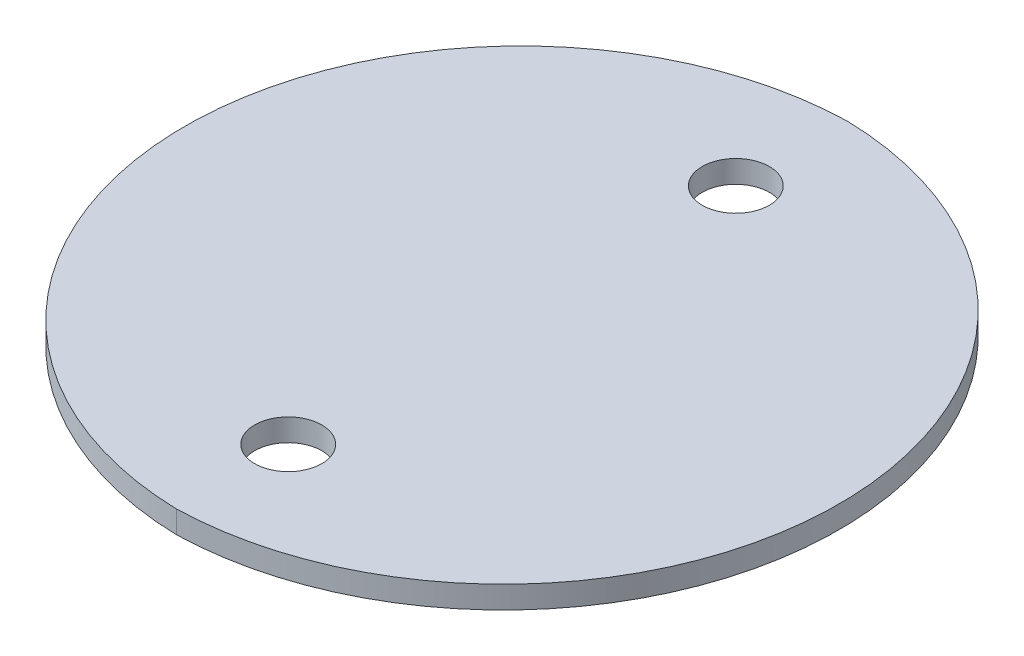
ISO-10303-21;
HEADER;
FILE_DESCRIPTION(('STEP AP214'),'2;1');
FILE_NAME('part.step','',(''),(''),'','','');
FILE_SCHEMA(('AUTOMOTIVE_DESIGN { 1 0 10303 214 1 1 1 1 }'));
ENDSEC;
DATA;
#1=APPLICATION_CONTEXT('core data for automotive mechanical design processes');
#2=APPLICATION_PROTOCOL_DEFINITION('international standard','automotive_design',2000,#1);
#3=PRODUCT_CONTEXT('',#1,'mechanical');
#4=PRODUCT('Part','Part','',(#3));
#5=PRODUCT_RELATED_PRODUCT_CATEGORY('part','',(#4));
#6=PRODUCT_DEFINITION_FORMATION('','',#4);
#7=PRODUCT_DEFINITION_CONTEXT('part definition',#1,'design');
#8=PRODUCT_DEFINITION('design','',#6,#7);
#9=PRODUCT_DEFINITION_SHAPE('','',#8);
#10=(LENGTH_UNIT() NAMED_UNIT(*) SI_UNIT(.MILLI.,.METRE.));
#11=(NAMED_UNIT(*) PLANE_ANGLE_UNIT() SI_UNIT($,.RADIAN.));
#12=(NAMED_UNIT(*) SI_UNIT($,.STERADIAN.) SOLID_ANGLE_UNIT());
#13=UNCERTAINTY_MEASURE_WITH_UNIT(LENGTH_MEASURE(1.E-05),#10,'distance_accuracy_value','');
#14=(GEOMETRIC_REPRESENTATION_CONTEXT(3) GLOBAL_UNCERTAINTY_ASSIGNED_CONTEXT((#13)) GLOBAL_UNIT_ASSIGNED_CONTEXT((#10,
#11,#12)) REPRESENTATION_CONTEXT('',''));
#15=CARTESIAN_POINT('',(0.,0.,0.));
#16=DIRECTION('',(0.,0.,1.));
#17=DIRECTION('',(1.,0.,0.));
#18=AXIS2_PLACEMENT_3D('',#15,#16,#17);
#19=CARTESIAN_POINT('',(0.,1.,0.));
#20=DIRECTION('',(0.,-1.,0.));
#21=DIRECTION('',(0.,0.,-1.));
#22=AXIS2_PLACEMENT_3D('',#19,#20,#21);
#23=PLANE('',#22);
#24=CARTESIAN_POINT('',(-0.387330608137351,1.,0.));
#25=DIRECTION('',(0.,1.,0.));
#26=DIRECTION('',(0.,0.,-1.));
#27=AXIS2_PLACEMENT_3D('',#24,#25,#26);
#28=CIRCLE('',#27,15.005);
#29=CARTESIAN_POINT('',(0.,1.,15.));
#30=VERTEX_POINT('',#29);
#31=CARTESIAN_POINT('',(0.,1.,-15.));
#32=VERTEX_POINT('',#31);
#33=EDGE_CURVE('E63',#30,#32,#28,.T.);
#34=ORIENTED_EDGE('',*,*,#33,.T.);
#35=CARTESIAN_POINT('',(0.387330608137346,1.,0.));
#36=DIRECTION('',(0.,1.,0.));
#37=DIRECTION('',(0.,0.,1.));
#38=AXIS2_PLACEMENT_3D('',#35,#36,#37);
#39=CIRCLE('',#38,15.005);
#40=EDGE_CURVE('E48',#32,#30,#39,.T.);
#41=ORIENTED_EDGE('',*,*,#40,.T.);
#42=EDGE_LOOP('',(#34,#41));
#43=FACE_BOUND('',#42,.T.);
#44=CARTESIAN_POINT('',(0.,1.,-10.));
#45=DIRECTION('',(0.,1.,0.));
#46=DIRECTION('',(0.,0.,1.));
#47=AXIS2_PLACEMENT_3D('',#44,#45,#46);
#48=CIRCLE('',#47,1.5);
#49=CARTESIAN_POINT('',(0.,1.,-8.5));
#50=VERTEX_POINT('',#49);
#51=EDGE_CURVE('E69',#50,#50,#48,.T.);
#52=ORIENTED_EDGE('',*,*,#51,.F.);
#53=EDGE_LOOP('',(#52));
#54=FACE_BOUND('',#53,.T.);
#55=CARTESIAN_POINT('',(0.,1.,10.));
#56=DIRECTION('',(0.,1.,0.));
#57=DIRECTION('',(0.,0.,-1.));
#58=AXIS2_PLACEMENT_3D('',#55,#56,#57);
#59=CIRCLE('',#58,1.5);
#60=CARTESIAN_POINT('',(0.,1.,8.5));
#61=VERTEX_POINT('',#60);
#62=EDGE_CURVE('E78',#61,#61,#59,.T.);
#63=ORIENTED_EDGE('',*,*,#62,.F.);
#64=EDGE_LOOP('',(#63));
#65=FACE_BOUND('',#64,.T.);
#66=ADVANCED_FACE('F32',(#43,#54,#65),#23,.F.);
#67=CARTESIAN_POINT('',(0.,0.,0.));
#68=DIRECTION('',(0.,-1.,0.));
#69=DIRECTION('',(0.,0.,-1.));
#70=AXIS2_PLACEMENT_3D('',#67,#68,#69);
#71=PLANE('',#70);
#72=CARTESIAN_POINT('',(0.,0.,-10.));
#73=DIRECTION('',(0.,1.,0.));
#74=DIRECTION('',(0.,0.,1.));
#75=AXIS2_PLACEMENT_3D('',#72,#73,#74);
#76=CIRCLE('',#75,1.5);
#77=CARTESIAN_POINT('',(0.,0.,-8.5));
#78=VERTEX_POINT('',#77);
#79=EDGE_CURVE('E72',#78,#78,#76,.T.);
#80=ORIENTED_EDGE('',*,*,#79,.T.);
#81=EDGE_LOOP('',(#80));
#82=FACE_BOUND('',#81,.T.);
#83=CARTESIAN_POINT('',(-0.387330608137351,0.,0.));
#84=DIRECTION('',(0.,1.,0.));
#85=DIRECTION('',(0.,0.,-1.));
#86=AXIS2_PLACEMENT_3D('',#83,#84,#85);
#87=CIRCLE('',#86,15.005);
#88=CARTESIAN_POINT('',(0.,0.,15.));
#89=VERTEX_POINT('',#88);
#90=CARTESIAN_POINT('',(0.,0.,-15.));
#91=VERTEX_POINT('',#90);
#92=EDGE_CURVE('E64',#89,#91,#87,.T.);
#93=ORIENTED_EDGE('',*,*,#92,.F.);
#94=CARTESIAN_POINT('',(0.387330608137346,0.,0.));
#95=DIRECTION('',(0.,1.,0.));
#96=DIRECTION('',(0.,0.,1.));
#97=AXIS2_PLACEMENT_3D('',#94,#95,#96);
#98=CIRCLE('',#97,15.005);
#99=EDGE_CURVE('E56',#91,#89,#98,.T.);
#100=ORIENTED_EDGE('',*,*,#99,.F.);
#101=EDGE_LOOP('',(#93,#100));
#102=FACE_BOUND('',#101,.T.);
#103=CARTESIAN_POINT('',(0.,0.,10.));
#104=DIRECTION('',(0.,1.,0.));
#105=DIRECTION('',(0.,0.,-1.));
#106=AXIS2_PLACEMENT_3D('',#103,#104,#105);
#107=CIRCLE('',#106,1.5);
#108=CARTESIAN_POINT('',(0.,0.,8.5));
#109=VERTEX_POINT('',#108);
#110=EDGE_CURVE('E80',#109,#109,#107,.T.);
#111=ORIENTED_EDGE('',*,*,#110,.T.);
#112=EDGE_LOOP('',(#111));
#113=FACE_BOUND('',#112,.T.);
#114=ADVANCED_FACE('F67',(#82,#102,#113),#71,.T.);
#115=CARTESIAN_POINT('',(-0.387330608137351,1.,0.));
#116=DIRECTION('',(0.,-1.,0.));
#117=DIRECTION('',(0.,0.,-1.));
#118=AXIS2_PLACEMENT_3D('',#115,#116,#117);
#119=CYLINDRICAL_SURFACE('',#118,15.005);
#120=ORIENTED_EDGE('',*,*,#92,.T.);
#121=DIRECTION('',(0.,-1.,0.));
#122=VECTOR('',#121,1.);
#123=CARTESIAN_POINT('',(0.,1.,-15.));
#124=LINE('',#123,#122);
#125=EDGE_CURVE('E11',#32,#91,#124,.T.);
#126=ORIENTED_EDGE('',*,*,#125,.F.);
#127=ORIENTED_EDGE('',*,*,#33,.F.);
#128=DIRECTION('',(0.,-1.,0.));
#129=VECTOR('',#128,1.);
#130=CARTESIAN_POINT('',(0.,1.,15.));
#131=LINE('',#130,#129);
#132=EDGE_CURVE('E41',#30,#89,#131,.T.);
#133=ORIENTED_EDGE('',*,*,#132,.T.);
#134=EDGE_LOOP('',(#120,#126,#127,#133));
#135=FACE_BOUND('',#134,.T.);
#136=ADVANCED_FACE('F34',(#135),#119,.T.);
#137=CARTESIAN_POINT('',(0.387330608137346,1.,0.));
#138=DIRECTION('',(0.,-1.,0.));
#139=DIRECTION('',(0.,0.,-1.));
#140=AXIS2_PLACEMENT_3D('',#137,#138,#139);
#141=CYLINDRICAL_SURFACE('',#140,15.005);
#142=ORIENTED_EDGE('',*,*,#99,.T.);
#143=ORIENTED_EDGE('',*,*,#132,.F.);
#144=ORIENTED_EDGE('',*,*,#40,.F.);
#145=ORIENTED_EDGE('',*,*,#125,.T.);
#146=EDGE_LOOP('',(#142,#143,#144,#145));
#147=FACE_BOUND('',#146,.T.);
#148=ADVANCED_FACE('F59',(#147),#141,.T.);
#149=CARTESIAN_POINT('',(0.,1.,-10.));
#150=DIRECTION('',(0.,-1.,0.));
#151=DIRECTION('',(0.,0.,-1.));
#152=AXIS2_PLACEMENT_3D('',#149,#150,#151);
#153=CYLINDRICAL_SURFACE('',#152,1.5);
#154=ORIENTED_EDGE('',*,*,#51,.T.);
#155=EDGE_LOOP('',(#154));
#156=FACE_BOUND('',#155,.T.);
#157=ORIENTED_EDGE('',*,*,#79,.F.);
#158=EDGE_LOOP('',(#157));
#159=FACE_BOUND('',#158,.T.);
#160=ADVANCED_FACE('F98',(#156,#159),#153,.F.);
#161=CARTESIAN_POINT('',(0.,1.,10.));
#162=DIRECTION('',(0.,-1.,0.));
#163=DIRECTION('',(0.,0.,-1.));
#164=AXIS2_PLACEMENT_3D('',#161,#162,#163);
#165=CYLINDRICAL_SURFACE('',#164,1.5);
#166=ORIENTED_EDGE('',*,*,#62,.T.);
#167=EDGE_LOOP('',(#166));
#168=FACE_BOUND('',#167,.T.);
#169=ORIENTED_EDGE('',*,*,#110,.F.);
#170=EDGE_LOOP('',(#169));
#171=FACE_BOUND('',#170,.T.);
#172=ADVANCED_FACE('F86',(#168,#171),#165,.F.);
#173=CLOSED_SHELL('',(#66,#114,#136,#148,#160,#172));
#174=MANIFOLD_SOLID_BREP('B2',#173);
#175=ADVANCED_BREP_SHAPE_REPRESENTATION('',(#18,#174),#14);
#176=SHAPE_DEFINITION_REPRESENTATION(#9,#175);
ENDSEC;
END-ISO-10303-21;
